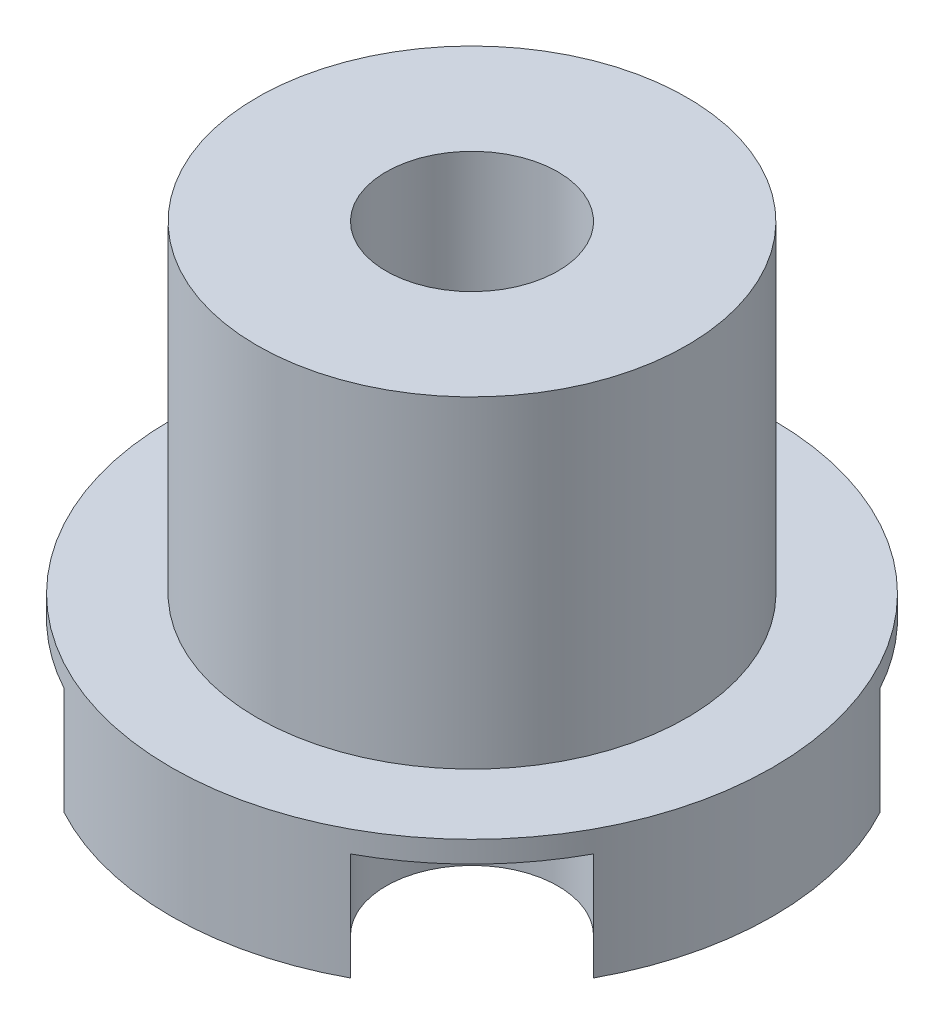
ISO-10303-21;
HEADER;
FILE_DESCRIPTION(('STEP AP214'),'2;1');
FILE_NAME('part.step','',(''),(''),'','','');
FILE_SCHEMA(('AUTOMOTIVE_DESIGN { 1 0 10303 214 1 1 1 1 }'));
ENDSEC;
DATA;
#1=APPLICATION_CONTEXT('core data for automotive mechanical design processes');
#2=APPLICATION_PROTOCOL_DEFINITION('international standard','automotive_design',2000,#1);
#3=PRODUCT_CONTEXT('',#1,'mechanical');
#4=PRODUCT('Part','Part','',(#3));
#5=PRODUCT_RELATED_PRODUCT_CATEGORY('part','',(#4));
#6=PRODUCT_DEFINITION_FORMATION('','',#4);
#7=PRODUCT_DEFINITION_CONTEXT('part definition',#1,'design');
#8=PRODUCT_DEFINITION('design','',#6,#7);
#9=PRODUCT_DEFINITION_SHAPE('','',#8);
#10=(LENGTH_UNIT() NAMED_UNIT(*) SI_UNIT(.MILLI.,.METRE.));
#11=(NAMED_UNIT(*) PLANE_ANGLE_UNIT() SI_UNIT($,.RADIAN.));
#12=(NAMED_UNIT(*) SI_UNIT($,.STERADIAN.) SOLID_ANGLE_UNIT());
#13=UNCERTAINTY_MEASURE_WITH_UNIT(LENGTH_MEASURE(1.E-05),#10,'distance_accuracy_value','');
#14=(GEOMETRIC_REPRESENTATION_CONTEXT(3) GLOBAL_UNCERTAINTY_ASSIGNED_CONTEXT((#13)) GLOBAL_UNIT_ASSIGNED_CONTEXT((#10,
#11,#12)) REPRESENTATION_CONTEXT('',''));
#15=CARTESIAN_POINT('',(0.,0.,0.));
#16=DIRECTION('',(0.,0.,1.));
#17=DIRECTION('',(1.,0.,0.));
#18=AXIS2_PLACEMENT_3D('',#15,#16,#17);
#19=CARTESIAN_POINT('',(-7.77817459305196,5.,-7.77817459305209));
#20=DIRECTION('',(0.,-1.,0.));
#21=DIRECTION('',(0.,0.,-1.));
#22=AXIS2_PLACEMENT_3D('',#19,#20,#21);
#23=CYLINDRICAL_SURFACE('',#22,4.);
#24=CARTESIAN_POINT('',(-7.77817459305196,0.,-7.77817459305209));
#25=DIRECTION('',(0.,-1.,0.));
#26=DIRECTION('',(0.,0.,-1.));
#27=AXIS2_PLACEMENT_3D('',#24,#25,#26);
#28=CIRCLE('',#27,4.);
#29=CARTESIAN_POINT('',(-4.94974746830567,0.,-10.606601717798));
#30=VERTEX_POINT('',#29);
#31=CARTESIAN_POINT('',(-10.6066017177982,0.,-4.94974746830575));
#32=VERTEX_POINT('',#31);
#33=EDGE_CURVE('E165',#30,#32,#28,.T.);
#34=ORIENTED_EDGE('',*,*,#33,.T.);
#35=DIRECTION('',(0.,-1.,0.));
#36=VECTOR('',#35,1.);
#37=CARTESIAN_POINT('',(-10.6066017177982,5.,-4.94974746830575));
#38=LINE('',#37,#36);
#39=CARTESIAN_POINT('',(-10.6066017177982,5.,-4.94974746830575));
#40=VERTEX_POINT('',#39);
#41=EDGE_CURVE('E151',#40,#32,#38,.T.);
#42=ORIENTED_EDGE('',*,*,#41,.F.);
#43=CARTESIAN_POINT('',(-7.77817459305196,5.,-7.77817459305209));
#44=DIRECTION('',(0.,-1.,0.));
#45=DIRECTION('',(0.,0.,-1.));
#46=AXIS2_PLACEMENT_3D('',#43,#44,#45);
#47=CIRCLE('',#46,4.);
#48=CARTESIAN_POINT('',(-4.94974746830578,5.,-10.6066017177983));
#49=VERTEX_POINT('',#48);
#50=EDGE_CURVE('E163',#49,#40,#47,.T.);
#51=ORIENTED_EDGE('',*,*,#50,.F.);
#52=DIRECTION('',(0.,-1.,0.));
#53=VECTOR('',#52,1.);
#54=CARTESIAN_POINT('',(-4.94974746830567,5.,-10.606601717798));
#55=LINE('',#54,#53);
#56=EDGE_CURVE('E49',#49,#30,#55,.T.);
#57=ORIENTED_EDGE('',*,*,#56,.T.);
#58=EDGE_LOOP('',(#34,#42,#51,#57));
#59=FACE_BOUND('',#58,.T.);
#60=ADVANCED_FACE('F34',(#59),#23,.F.);
#61=CARTESIAN_POINT('',(7.77817459305212,5.,-7.77817459305193));
#62=DIRECTION('',(0.,-1.,0.));
#63=DIRECTION('',(0.,0.,-1.));
#64=AXIS2_PLACEMENT_3D('',#61,#62,#63);
#65=CYLINDRICAL_SURFACE('',#64,4.);
#66=CARTESIAN_POINT('',(7.77817459305212,0.,-7.77817459305193));
#67=DIRECTION('',(0.,-1.,0.));
#68=DIRECTION('',(0.,0.,-1.));
#69=AXIS2_PLACEMENT_3D('',#66,#67,#68);
#70=CIRCLE('',#69,4.);
#71=CARTESIAN_POINT('',(10.606601717798,0.,-4.94974746830556));
#72=VERTEX_POINT('',#71);
#73=CARTESIAN_POINT('',(4.94974746830586,0.,-10.6066017177982));
#74=VERTEX_POINT('',#73);
#75=EDGE_CURVE('E169',#72,#74,#70,.T.);
#76=ORIENTED_EDGE('',*,*,#75,.T.);
#77=DIRECTION('',(0.,-1.,0.));
#78=VECTOR('',#77,1.);
#79=CARTESIAN_POINT('',(4.94974746830586,5.,-10.6066017177982));
#80=LINE('',#79,#78);
#81=CARTESIAN_POINT('',(4.94974746830586,5.,-10.6066017177982));
#82=VERTEX_POINT('',#81);
#83=EDGE_CURVE('E254',#82,#74,#80,.T.);
#84=ORIENTED_EDGE('',*,*,#83,.F.);
#85=CARTESIAN_POINT('',(7.77817459305212,5.,-7.77817459305193));
#86=DIRECTION('',(0.,-1.,0.));
#87=DIRECTION('',(0.,0.,-1.));
#88=AXIS2_PLACEMENT_3D('',#85,#86,#87);
#89=CIRCLE('',#88,4.);
#90=CARTESIAN_POINT('',(10.6066017177983,5.,-4.94974746830572));
#91=VERTEX_POINT('',#90);
#92=EDGE_CURVE('E172',#91,#82,#89,.T.);
#93=ORIENTED_EDGE('',*,*,#92,.F.);
#94=DIRECTION('',(0.,-1.,0.));
#95=VECTOR('',#94,1.);
#96=CARTESIAN_POINT('',(10.606601717798,5.,-4.94974746830556));
#97=LINE('',#96,#95);
#98=EDGE_CURVE('E57',#91,#72,#97,.T.);
#99=ORIENTED_EDGE('',*,*,#98,.T.);
#100=EDGE_LOOP('',(#76,#84,#93,#99));
#101=FACE_BOUND('',#100,.T.);
#102=ADVANCED_FACE('F347',(#101),#65,.F.);
#103=CARTESIAN_POINT('',(7.77817459305201,5.,7.77817459305204));
#104=DIRECTION('',(0.,-1.,0.));
#105=DIRECTION('',(0.,0.,-1.));
#106=AXIS2_PLACEMENT_3D('',#103,#104,#105);
#107=CYLINDRICAL_SURFACE('',#106,4.);
#108=CARTESIAN_POINT('',(7.77817459305201,0.,7.77817459305204));
#109=DIRECTION('',(0.,1.,0.));
#110=DIRECTION('',(0.,0.,1.));
#111=AXIS2_PLACEMENT_3D('',#108,#109,#110);
#112=CIRCLE('',#111,4.);
#113=CARTESIAN_POINT('',(10.6066017177982,0.,4.94974746830582));
#114=VERTEX_POINT('',#113);
#115=CARTESIAN_POINT('',(4.9497474683056,0.,10.606601717798));
#116=VERTEX_POINT('',#115);
#117=EDGE_CURVE('E230',#114,#116,#112,.T.);
#118=ORIENTED_EDGE('',*,*,#117,.F.);
#119=DIRECTION('',(0.,-1.,0.));
#120=VECTOR('',#119,1.);
#121=CARTESIAN_POINT('',(10.6066017177982,5.,4.94974746830582));
#122=LINE('',#121,#120);
#123=CARTESIAN_POINT('',(10.6066017177982,5.,4.94974746830582));
#124=VERTEX_POINT('',#123);
#125=EDGE_CURVE('E271',#124,#114,#122,.T.);
#126=ORIENTED_EDGE('',*,*,#125,.F.);
#127=CARTESIAN_POINT('',(7.77817459305201,5.,7.77817459305204));
#128=DIRECTION('',(0.,-1.,0.));
#129=DIRECTION('',(0.,0.,-1.));
#130=AXIS2_PLACEMENT_3D('',#127,#128,#129);
#131=CIRCLE('',#130,4.);
#132=CARTESIAN_POINT('',(4.94974746830581,5.,10.6066017177982));
#133=VERTEX_POINT('',#132);
#134=EDGE_CURVE('E180',#133,#124,#131,.T.);
#135=ORIENTED_EDGE('',*,*,#134,.F.);
#136=DIRECTION('',(0.,-1.,0.));
#137=VECTOR('',#136,1.);
#138=CARTESIAN_POINT('',(4.9497474683056,5.,10.606601717798));
#139=LINE('',#138,#137);
#140=EDGE_CURVE('E268',#133,#116,#139,.T.);
#141=ORIENTED_EDGE('',*,*,#140,.T.);
#142=EDGE_LOOP('',(#118,#126,#135,#141));
#143=FACE_BOUND('',#142,.T.);
#144=ADVANCED_FACE('F314',(#143),#107,.F.);
#145=CARTESIAN_POINT('',(-7.77817459305206,5.,7.77817459305198));
#146=DIRECTION('',(0.,-1.,0.));
#147=DIRECTION('',(0.,0.,-1.));
#148=AXIS2_PLACEMENT_3D('',#145,#146,#147);
#149=CYLINDRICAL_SURFACE('',#148,4.);
#150=CARTESIAN_POINT('',(-7.77817459305206,0.,7.77817459305198));
#151=DIRECTION('',(0.,1.,0.));
#152=DIRECTION('',(0.,0.,1.));
#153=AXIS2_PLACEMENT_3D('',#150,#151,#152);
#154=CIRCLE('',#153,4.);
#155=CARTESIAN_POINT('',(-4.94974746830586,0.,10.6066017177982));
#156=VERTEX_POINT('',#155);
#157=CARTESIAN_POINT('',(-10.606601717798,0.,4.94974746830556));
#158=VERTEX_POINT('',#157);
#159=EDGE_CURVE('E221',#156,#158,#154,.T.);
#160=ORIENTED_EDGE('',*,*,#159,.F.);
#161=DIRECTION('',(0.,-1.,0.));
#162=VECTOR('',#161,1.);
#163=CARTESIAN_POINT('',(-4.94974746830586,5.,10.6066017177982));
#164=LINE('',#163,#162);
#165=CARTESIAN_POINT('',(-4.94974746830586,5.,10.6066017177982));
#166=VERTEX_POINT('',#165);
#167=EDGE_CURVE('E291',#166,#156,#164,.T.);
#168=ORIENTED_EDGE('',*,*,#167,.F.);
#169=CARTESIAN_POINT('',(-7.77817459305206,5.,7.77817459305198));
#170=DIRECTION('',(0.,-1.,0.));
#171=DIRECTION('',(0.,0.,-1.));
#172=AXIS2_PLACEMENT_3D('',#169,#170,#171);
#173=CIRCLE('',#172,4.);
#174=CARTESIAN_POINT('',(-10.6066017177982,5.,4.94974746830577));
#175=VERTEX_POINT('',#174);
#176=EDGE_CURVE('E184',#175,#166,#173,.T.);
#177=ORIENTED_EDGE('',*,*,#176,.F.);
#178=DIRECTION('',(0.,-1.,0.));
#179=VECTOR('',#178,1.);
#180=CARTESIAN_POINT('',(-10.606601717798,5.,4.94974746830556));
#181=LINE('',#180,#179);
#182=EDGE_CURVE('E288',#175,#158,#181,.T.);
#183=ORIENTED_EDGE('',*,*,#182,.T.);
#184=EDGE_LOOP('',(#160,#168,#177,#183));
#185=FACE_BOUND('',#184,.T.);
#186=ADVANCED_FACE('F332',(#185),#149,.F.);
#187=CARTESIAN_POINT('',(0.,6.,0.));
#188=DIRECTION('',(0.,1.,0.));
#189=DIRECTION('',(0.,0.,1.));
#190=AXIS2_PLACEMENT_3D('',#187,#188,#189);
#191=PLANE('',#190);
#192=CARTESIAN_POINT('',(0.,6.,0.));
#193=DIRECTION('',(0.,1.,0.));
#194=DIRECTION('',(0.,0.,1.));
#195=AXIS2_PLACEMENT_3D('',#192,#193,#194);
#196=CIRCLE('',#195,14.);
#197=CARTESIAN_POINT('',(0.,6.,14.));
#198=VERTEX_POINT('',#197);
#199=EDGE_CURVE('E218',#198,#198,#196,.T.);
#200=ORIENTED_EDGE('',*,*,#199,.T.);
#201=EDGE_LOOP('',(#200));
#202=FACE_BOUND('',#201,.T.);
#203=CARTESIAN_POINT('',(0.,6.,0.));
#204=DIRECTION('',(0.,1.,0.));
#205=DIRECTION('',(0.,0.,1.));
#206=AXIS2_PLACEMENT_3D('',#203,#204,#205);
#207=CIRCLE('',#206,10.);
#208=CARTESIAN_POINT('',(0.,6.,10.));
#209=VERTEX_POINT('',#208);
#210=EDGE_CURVE('E209',#209,#209,#207,.T.);
#211=ORIENTED_EDGE('',*,*,#210,.F.);
#212=EDGE_LOOP('',(#211));
#213=FACE_BOUND('',#212,.T.);
#214=ADVANCED_FACE('F366',(#202,#213),#191,.T.);
#215=CARTESIAN_POINT('',(0.,6.,0.));
#216=DIRECTION('',(0.,-1.,0.));
#217=DIRECTION('',(0.,0.,-1.));
#218=AXIS2_PLACEMENT_3D('',#215,#216,#217);
#219=CYLINDRICAL_SURFACE('',#218,14.);
#220=CARTESIAN_POINT('',(0.,0.,0.));
#221=DIRECTION('',(0.,1.,0.));
#222=DIRECTION('',(0.,0.,1.));
#223=AXIS2_PLACEMENT_3D('',#220,#221,#222);
#224=CIRCLE('',#223,14.);
#225=CARTESIAN_POINT('',(6.65840585575901,0.,-12.3152601052513));
#226=VERTEX_POINT('',#225);
#227=CARTESIAN_POINT('',(-6.658405855759,0.,-12.3152601052513));
#228=VERTEX_POINT('',#227);
#229=EDGE_CURVE('E323',#226,#228,#224,.T.);
#230=ORIENTED_EDGE('',*,*,#229,.T.);
#231=DIRECTION('',(0.,-1.,0.));
#232=VECTOR('',#231,1.);
#233=CARTESIAN_POINT('',(-6.658405855759,6.,-12.3152601052513));
#234=LINE('',#233,#232);
#235=CARTESIAN_POINT('',(-6.658405855759,5.,-12.3152601052513));
#236=VERTEX_POINT('',#235);
#237=EDGE_CURVE('E166',#228,#236,#234,.F.);
#238=ORIENTED_EDGE('',*,*,#237,.T.);
#239=CARTESIAN_POINT('',(0.,5.,0.));
#240=DIRECTION('',(0.,-1.,0.));
#241=DIRECTION('',(0.,0.,-1.));
#242=AXIS2_PLACEMENT_3D('',#239,#240,#241);
#243=CIRCLE('',#242,14.);
#244=CARTESIAN_POINT('',(-12.3152601052514,5.,-6.65840585575889));
#245=VERTEX_POINT('',#244);
#246=EDGE_CURVE('E11',#245,#236,#243,.T.);
#247=ORIENTED_EDGE('',*,*,#246,.F.);
#248=DIRECTION('',(0.,-1.,0.));
#249=VECTOR('',#248,1.);
#250=CARTESIAN_POINT('',(-12.3152601052514,6.,-6.65840585575889));
#251=LINE('',#250,#249);
#252=CARTESIAN_POINT('',(-12.3152601052514,0.,-6.65840585575889));
#253=VERTEX_POINT('',#252);
#254=EDGE_CURVE('E154',#245,#253,#251,.T.);
#255=ORIENTED_EDGE('',*,*,#254,.T.);
#256=CARTESIAN_POINT('',(-12.3152601052514,0.,6.65840585575887));
#257=VERTEX_POINT('',#256);
#258=EDGE_CURVE('E215',#253,#257,#224,.T.);
#259=ORIENTED_EDGE('',*,*,#258,.T.);
#260=DIRECTION('',(0.,-1.,0.));
#261=VECTOR('',#260,1.);
#262=CARTESIAN_POINT('',(-12.3152601052514,6.,6.65840585575887));
#263=LINE('',#262,#261);
#264=CARTESIAN_POINT('',(-12.3152601052514,5.,6.65840585575887));
#265=VERTEX_POINT('',#264);
#266=EDGE_CURVE('E293',#257,#265,#263,.F.);
#267=ORIENTED_EDGE('',*,*,#266,.T.);
#268=CARTESIAN_POINT('',(0.,5.,0.));
#269=DIRECTION('',(0.,-1.,0.));
#270=DIRECTION('',(0.,0.,-1.));
#271=AXIS2_PLACEMENT_3D('',#268,#269,#270);
#272=CIRCLE('',#271,14.);
#273=CARTESIAN_POINT('',(-6.65840585575901,5.,12.3152601052513));
#274=VERTEX_POINT('',#273);
#275=EDGE_CURVE('E228',#274,#265,#272,.T.);
#276=ORIENTED_EDGE('',*,*,#275,.F.);
#277=DIRECTION('',(0.,-1.,0.));
#278=VECTOR('',#277,1.);
#279=CARTESIAN_POINT('',(-6.65840585575901,6.,12.3152601052513));
#280=LINE('',#279,#278);
#281=CARTESIAN_POINT('',(-6.65840585575901,0.,12.3152601052513));
#282=VERTEX_POINT('',#281);
#283=EDGE_CURVE('E174',#274,#282,#280,.T.);
#284=ORIENTED_EDGE('',*,*,#283,.T.);
#285=CARTESIAN_POINT('',(6.65840585575891,0.,12.3152601052513));
#286=VERTEX_POINT('',#285);
#287=EDGE_CURVE('E222',#282,#286,#224,.T.);
#288=ORIENTED_EDGE('',*,*,#287,.T.);
#289=DIRECTION('',(0.,-1.,0.));
#290=VECTOR('',#289,1.);
#291=CARTESIAN_POINT('',(6.65840585575891,6.,12.3152601052513));
#292=LINE('',#291,#290);
#293=CARTESIAN_POINT('',(6.65840585575891,5.,12.3152601052513));
#294=VERTEX_POINT('',#293);
#295=EDGE_CURVE('E273',#286,#294,#292,.F.);
#296=ORIENTED_EDGE('',*,*,#295,.T.);
#297=CARTESIAN_POINT('',(0.,5.,0.));
#298=DIRECTION('',(0.,-1.,0.));
#299=DIRECTION('',(0.,0.,-1.));
#300=AXIS2_PLACEMENT_3D('',#297,#298,#299);
#301=CIRCLE('',#300,14.);
#302=CARTESIAN_POINT('',(12.3152601052513,5.,6.65840585575897));
#303=VERTEX_POINT('',#302);
#304=EDGE_CURVE('E233',#303,#294,#301,.T.);
#305=ORIENTED_EDGE('',*,*,#304,.F.);
#306=DIRECTION('',(0.,-1.,0.));
#307=VECTOR('',#306,1.);
#308=CARTESIAN_POINT('',(12.3152601052513,6.,6.65840585575897));
#309=LINE('',#308,#307);
#310=CARTESIAN_POINT('',(12.3152601052513,0.,6.65840585575897));
#311=VERTEX_POINT('',#310);
#312=EDGE_CURVE('E278',#303,#311,#309,.T.);
#313=ORIENTED_EDGE('',*,*,#312,.T.);
#314=CARTESIAN_POINT('',(12.3152601052514,0.,-6.65840585575887));
#315=VERTEX_POINT('',#314);
#316=EDGE_CURVE('E225',#311,#315,#224,.T.);
#317=ORIENTED_EDGE('',*,*,#316,.T.);
#318=DIRECTION('',(0.,-1.,0.));
#319=VECTOR('',#318,1.);
#320=CARTESIAN_POINT('',(12.3152601052514,6.,-6.65840585575887));
#321=LINE('',#320,#319);
#322=CARTESIAN_POINT('',(12.3152601052514,5.,-6.65840585575887));
#323=VERTEX_POINT('',#322);
#324=EDGE_CURVE('E245',#315,#323,#321,.F.);
#325=ORIENTED_EDGE('',*,*,#324,.T.);
#326=CARTESIAN_POINT('',(0.,5.,0.));
#327=DIRECTION('',(0.,-1.,0.));
#328=DIRECTION('',(0.,0.,-1.));
#329=AXIS2_PLACEMENT_3D('',#326,#327,#328);
#330=CIRCLE('',#329,14.);
#331=CARTESIAN_POINT('',(6.65840585575901,5.,-12.3152601052513));
#332=VERTEX_POINT('',#331);
#333=EDGE_CURVE('E42',#332,#323,#330,.T.);
#334=ORIENTED_EDGE('',*,*,#333,.F.);
#335=DIRECTION('',(0.,-1.,0.));
#336=VECTOR('',#335,1.);
#337=CARTESIAN_POINT('',(6.65840585575901,6.,-12.3152601052513));
#338=LINE('',#337,#336);
#339=EDGE_CURVE('E253',#332,#226,#338,.T.);
#340=ORIENTED_EDGE('',*,*,#339,.T.);
#341=EDGE_LOOP('',(#230,#238,#247,#255,#259,#267,#276,#284,#288,#296,#305,#313,#317,#325,#334,#340));
#342=FACE_BOUND('',#341,.T.);
#343=ORIENTED_EDGE('',*,*,#199,.F.);
#344=EDGE_LOOP('',(#343));
#345=FACE_BOUND('',#344,.T.);
#346=ADVANCED_FACE('F36',(#342,#345),#219,.T.);
#347=CARTESIAN_POINT('',(0.,0.,0.));
#348=DIRECTION('',(0.,1.,0.));
#349=DIRECTION('',(0.,0.,1.));
#350=AXIS2_PLACEMENT_3D('',#347,#348,#349);
#351=PLANE('',#350);
#352=CARTESIAN_POINT('',(0.,0.,0.));
#353=DIRECTION('',(0.,-1.,0.));
#354=DIRECTION('',(0.,0.,-1.));
#355=AXIS2_PLACEMENT_3D('',#352,#353,#354);
#356=CIRCLE('',#355,4.);
#357=CARTESIAN_POINT('',(0.,0.,-4.));
#358=VERTEX_POINT('',#357);
#359=EDGE_CURVE('E416',#358,#358,#356,.T.);
#360=ORIENTED_EDGE('',*,*,#359,.F.);
#361=EDGE_LOOP('',(#360));
#362=FACE_BOUND('',#361,.T.);
#363=CARTESIAN_POINT('',(0.,0.,-9.5));
#364=DIRECTION('',(0.,-1.,0.));
#365=DIRECTION('',(0.,0.,-1.));
#366=AXIS2_PLACEMENT_3D('',#363,#364,#365);
#367=CIRCLE('',#366,1.);
#368=CARTESIAN_POINT('',(0.,0.,-10.5));
#369=VERTEX_POINT('',#368);
#370=EDGE_CURVE('E187',#369,#369,#367,.T.);
#371=ORIENTED_EDGE('',*,*,#370,.F.);
#372=EDGE_LOOP('',(#371));
#373=FACE_BOUND('',#372,.T.);
#374=CARTESIAN_POINT('',(0.,0.,9.5));
#375=DIRECTION('',(0.,-1.,0.));
#376=DIRECTION('',(0.,0.,-1.));
#377=AXIS2_PLACEMENT_3D('',#374,#375,#376);
#378=CIRCLE('',#377,1.);
#379=CARTESIAN_POINT('',(0.,0.,8.5));
#380=VERTEX_POINT('',#379);
#381=EDGE_CURVE('E191',#380,#380,#378,.T.);
#382=ORIENTED_EDGE('',*,*,#381,.F.);
#383=EDGE_LOOP('',(#382));
#384=FACE_BOUND('',#383,.T.);
#385=CARTESIAN_POINT('',(8.,0.,0.));
#386=DIRECTION('',(0.,-1.,0.));
#387=DIRECTION('',(0.,0.,-1.));
#388=AXIS2_PLACEMENT_3D('',#385,#386,#387);
#389=CIRCLE('',#388,1.);
#390=CARTESIAN_POINT('',(8.,0.,-1.));
#391=VERTEX_POINT('',#390);
#392=EDGE_CURVE('E197',#391,#391,#389,.T.);
#393=ORIENTED_EDGE('',*,*,#392,.F.);
#394=EDGE_LOOP('',(#393));
#395=FACE_BOUND('',#394,.T.);
#396=CARTESIAN_POINT('',(-8.,0.,0.));
#397=DIRECTION('',(0.,-1.,0.));
#398=DIRECTION('',(0.,0.,-1.));
#399=AXIS2_PLACEMENT_3D('',#396,#397,#398);
#400=CIRCLE('',#399,1.);
#401=CARTESIAN_POINT('',(-8.,0.,-1.));
#402=VERTEX_POINT('',#401);
#403=EDGE_CURVE('E203',#402,#402,#400,.T.);
#404=ORIENTED_EDGE('',*,*,#403,.F.);
#405=EDGE_LOOP('',(#404));
#406=FACE_BOUND('',#405,.T.);
#407=ORIENTED_EDGE('',*,*,#258,.F.);
#408=DIRECTION('',(-0.70710678118655,0.,-0.707106781186545));
#409=VECTOR('',#408,1.);
#410=CARTESIAN_POINT('',(-15.3332383130999,0.,-9.67638406360737));
#411=LINE('',#410,#409);
#412=EDGE_CURVE('E432',#32,#253,#411,.T.);
#413=ORIENTED_EDGE('',*,*,#412,.F.);
#414=ORIENTED_EDGE('',*,*,#33,.F.);
#415=DIRECTION('',(0.707106781186551,0.,0.707106781186544));
#416=VECTOR('',#415,1.);
#417=CARTESIAN_POINT('',(-4.94974746830567,0.,-10.606601717798));
#418=LINE('',#417,#416);
#419=EDGE_CURVE('E158',#228,#30,#418,.T.);
#420=ORIENTED_EDGE('',*,*,#419,.F.);
#421=ORIENTED_EDGE('',*,*,#229,.F.);
#422=DIRECTION('',(0.707106781186552,0.,-0.707106781186543));
#423=VECTOR('',#422,1.);
#424=CARTESIAN_POINT('',(9.67638406360753,0.,-15.3332383130998));
#425=LINE('',#424,#423);
#426=EDGE_CURVE('E441',#74,#226,#425,.T.);
#427=ORIENTED_EDGE('',*,*,#426,.F.);
#428=ORIENTED_EDGE('',*,*,#75,.F.);
#429=DIRECTION('',(-0.707106781186551,0.,0.707106781186544));
#430=VECTOR('',#429,1.);
#431=CARTESIAN_POINT('',(10.606601717798,0.,-4.94974746830556));
#432=LINE('',#431,#430);
#433=EDGE_CURVE('E322',#315,#72,#432,.T.);
#434=ORIENTED_EDGE('',*,*,#433,.F.);
#435=ORIENTED_EDGE('',*,*,#316,.F.);
#436=DIRECTION('',(0.707106781186545,0.,0.70710678118655));
#437=VECTOR('',#436,1.);
#438=CARTESIAN_POINT('',(15.3332383130998,0.,9.67638406360748));
#439=LINE('',#438,#437);
#440=EDGE_CURVE('E256',#114,#311,#439,.T.);
#441=ORIENTED_EDGE('',*,*,#440,.F.);
#442=ORIENTED_EDGE('',*,*,#117,.T.);
#443=DIRECTION('',(-0.707106781186546,0.,-0.707106781186549));
#444=VECTOR('',#443,1.);
#445=CARTESIAN_POINT('',(4.9497474683056,0.,10.606601717798));
#446=LINE('',#445,#444);
#447=EDGE_CURVE('E265',#286,#116,#446,.T.);
#448=ORIENTED_EDGE('',*,*,#447,.F.);
#449=ORIENTED_EDGE('',*,*,#287,.F.);
#450=DIRECTION('',(-0.707106781186552,0.,0.707106781186543));
#451=VECTOR('',#450,1.);
#452=CARTESIAN_POINT('',(-9.67638406360753,0.,15.3332383130998));
#453=LINE('',#452,#451);
#454=EDGE_CURVE('E280',#156,#282,#453,.T.);
#455=ORIENTED_EDGE('',*,*,#454,.F.);
#456=ORIENTED_EDGE('',*,*,#159,.T.);
#457=DIRECTION('',(0.707106781186551,0.,-0.707106781186544));
#458=VECTOR('',#457,1.);
#459=CARTESIAN_POINT('',(-10.606601717798,0.,4.94974746830556));
#460=LINE('',#459,#458);
#461=EDGE_CURVE('E285',#257,#158,#460,.T.);
#462=ORIENTED_EDGE('',*,*,#461,.F.);
#463=EDGE_LOOP('',(#407,#413,#414,#420,#421,#427,#428,#434,#435,#441,#442,#448,#449,#455,#456,#462));
#464=FACE_BOUND('',#463,.T.);
#465=ADVANCED_FACE('F305',(#362,#373,#384,#395,#406,#464),#351,.F.);
#466=CARTESIAN_POINT('',(0.,21.,0.));
#467=DIRECTION('',(0.,-1.,0.));
#468=DIRECTION('',(0.,0.,-1.));
#469=AXIS2_PLACEMENT_3D('',#466,#467,#468);
#470=CYLINDRICAL_SURFACE('',#469,10.);
#471=CARTESIAN_POINT('',(0.,21.,0.));
#472=DIRECTION('',(0.,1.,0.));
#473=DIRECTION('',(0.,0.,1.));
#474=AXIS2_PLACEMENT_3D('',#471,#472,#473);
#475=CIRCLE('',#474,10.);
#476=CARTESIAN_POINT('',(0.,21.,10.));
#477=VERTEX_POINT('',#476);
#478=EDGE_CURVE('E212',#477,#477,#475,.T.);
#479=ORIENTED_EDGE('',*,*,#478,.F.);
#480=EDGE_LOOP('',(#479));
#481=FACE_BOUND('',#480,.T.);
#482=ORIENTED_EDGE('',*,*,#210,.T.);
#483=EDGE_LOOP('',(#482));
#484=FACE_BOUND('',#483,.T.);
#485=ADVANCED_FACE('F401',(#481,#484),#470,.T.);
#486=CARTESIAN_POINT('',(0.,21.,0.));
#487=DIRECTION('',(0.,1.,0.));
#488=DIRECTION('',(0.,0.,1.));
#489=AXIS2_PLACEMENT_3D('',#486,#487,#488);
#490=PLANE('',#489);
#491=CARTESIAN_POINT('',(0.,21.,0.));
#492=DIRECTION('',(0.,-1.,0.));
#493=DIRECTION('',(0.,0.,-1.));
#494=AXIS2_PLACEMENT_3D('',#491,#492,#493);
#495=CIRCLE('',#494,4.);
#496=CARTESIAN_POINT('',(0.,21.,-4.));
#497=VERTEX_POINT('',#496);
#498=EDGE_CURVE('E429',#497,#497,#495,.T.);
#499=ORIENTED_EDGE('',*,*,#498,.T.);
#500=EDGE_LOOP('',(#499));
#501=FACE_BOUND('',#500,.T.);
#502=ORIENTED_EDGE('',*,*,#478,.T.);
#503=EDGE_LOOP('',(#502));
#504=FACE_BOUND('',#503,.T.);
#505=ADVANCED_FACE('F397',(#501,#504),#490,.T.);
#506=CARTESIAN_POINT('',(-8.,5.,0.));
#507=DIRECTION('',(0.,-1.,0.));
#508=DIRECTION('',(0.,0.,-1.));
#509=AXIS2_PLACEMENT_3D('',#506,#507,#508);
#510=CYLINDRICAL_SURFACE('',#509,1.);
#511=CARTESIAN_POINT('',(-8.,5.,0.));
#512=DIRECTION('',(0.,-1.,0.));
#513=DIRECTION('',(0.,0.,-1.));
#514=AXIS2_PLACEMENT_3D('',#511,#512,#513);
#515=CIRCLE('',#514,1.);
#516=CARTESIAN_POINT('',(-8.,5.,-1.));
#517=VERTEX_POINT('',#516);
#518=EDGE_CURVE('E206',#517,#517,#515,.T.);
#519=ORIENTED_EDGE('',*,*,#518,.F.);
#520=EDGE_LOOP('',(#519));
#521=FACE_BOUND('',#520,.T.);
#522=ORIENTED_EDGE('',*,*,#403,.T.);
#523=EDGE_LOOP('',(#522));
#524=FACE_BOUND('',#523,.T.);
#525=ADVANCED_FACE('F393',(#521,#524),#510,.F.);
#526=CARTESIAN_POINT('',(-8.,5.,0.));
#527=DIRECTION('',(0.,-1.,0.));
#528=DIRECTION('',(0.,0.,-1.));
#529=AXIS2_PLACEMENT_3D('',#526,#527,#528);
#530=PLANE('',#529);
#531=ORIENTED_EDGE('',*,*,#518,.T.);
#532=EDGE_LOOP('',(#531));
#533=FACE_BOUND('',#532,.T.);
#534=ADVANCED_FACE('F389',(#533),#530,.T.);
#535=CARTESIAN_POINT('',(8.,5.,0.));
#536=DIRECTION('',(0.,-1.,0.));
#537=DIRECTION('',(0.,0.,-1.));
#538=AXIS2_PLACEMENT_3D('',#535,#536,#537);
#539=CYLINDRICAL_SURFACE('',#538,1.);
#540=CARTESIAN_POINT('',(8.,5.,0.));
#541=DIRECTION('',(0.,-1.,0.));
#542=DIRECTION('',(0.,0.,-1.));
#543=AXIS2_PLACEMENT_3D('',#540,#541,#542);
#544=CIRCLE('',#543,1.);
#545=CARTESIAN_POINT('',(8.,5.,-1.));
#546=VERTEX_POINT('',#545);
#547=EDGE_CURVE('E200',#546,#546,#544,.T.);
#548=ORIENTED_EDGE('',*,*,#547,.F.);
#549=EDGE_LOOP('',(#548));
#550=FACE_BOUND('',#549,.T.);
#551=ORIENTED_EDGE('',*,*,#392,.T.);
#552=EDGE_LOOP('',(#551));
#553=FACE_BOUND('',#552,.T.);
#554=ADVANCED_FACE('F385',(#550,#553),#539,.F.);
#555=CARTESIAN_POINT('',(8.,5.,0.));
#556=DIRECTION('',(0.,-1.,0.));
#557=DIRECTION('',(0.,0.,-1.));
#558=AXIS2_PLACEMENT_3D('',#555,#556,#557);
#559=PLANE('',#558);
#560=ORIENTED_EDGE('',*,*,#547,.T.);
#561=EDGE_LOOP('',(#560));
#562=FACE_BOUND('',#561,.T.);
#563=ADVANCED_FACE('F381',(#562),#559,.T.);
#564=CARTESIAN_POINT('',(0.,5.,9.5));
#565=DIRECTION('',(0.,-1.,0.));
#566=DIRECTION('',(0.,0.,-1.));
#567=AXIS2_PLACEMENT_3D('',#564,#565,#566);
#568=CYLINDRICAL_SURFACE('',#567,1.);
#569=CARTESIAN_POINT('',(0.,5.,9.5));
#570=DIRECTION('',(0.,-1.,0.));
#571=DIRECTION('',(0.,0.,-1.));
#572=AXIS2_PLACEMENT_3D('',#569,#570,#571);
#573=CIRCLE('',#572,1.);
#574=CARTESIAN_POINT('',(0.,5.,8.5));
#575=VERTEX_POINT('',#574);
#576=EDGE_CURVE('E194',#575,#575,#573,.T.);
#577=ORIENTED_EDGE('',*,*,#576,.F.);
#578=EDGE_LOOP('',(#577));
#579=FACE_BOUND('',#578,.T.);
#580=ORIENTED_EDGE('',*,*,#381,.T.);
#581=EDGE_LOOP('',(#580));
#582=FACE_BOUND('',#581,.T.);
#583=ADVANCED_FACE('F377',(#579,#582),#568,.F.);
#584=CARTESIAN_POINT('',(0.,5.,9.5));
#585=DIRECTION('',(0.,-1.,0.));
#586=DIRECTION('',(0.,0.,-1.));
#587=AXIS2_PLACEMENT_3D('',#584,#585,#586);
#588=PLANE('',#587);
#589=ORIENTED_EDGE('',*,*,#576,.T.);
#590=EDGE_LOOP('',(#589));
#591=FACE_BOUND('',#590,.T.);
#592=ADVANCED_FACE('F373',(#591),#588,.T.);
#593=CARTESIAN_POINT('',(0.,5.,-9.5));
#594=DIRECTION('',(0.,-1.,0.));
#595=DIRECTION('',(0.,0.,-1.));
#596=AXIS2_PLACEMENT_3D('',#593,#594,#595);
#597=CYLINDRICAL_SURFACE('',#596,1.);
#598=CARTESIAN_POINT('',(0.,5.,-9.5));
#599=DIRECTION('',(0.,-1.,0.));
#600=DIRECTION('',(0.,0.,-1.));
#601=AXIS2_PLACEMENT_3D('',#598,#599,#600);
#602=CIRCLE('',#601,1.);
#603=CARTESIAN_POINT('',(0.,5.,-10.5));
#604=VERTEX_POINT('',#603);
#605=EDGE_CURVE('E188',#604,#604,#602,.T.);
#606=ORIENTED_EDGE('',*,*,#605,.F.);
#607=EDGE_LOOP('',(#606));
#608=FACE_BOUND('',#607,.T.);
#609=ORIENTED_EDGE('',*,*,#370,.T.);
#610=EDGE_LOOP('',(#609));
#611=FACE_BOUND('',#610,.T.);
#612=ADVANCED_FACE('F369',(#608,#611),#597,.F.);
#613=CARTESIAN_POINT('',(0.,5.,-9.5));
#614=DIRECTION('',(0.,-1.,0.));
#615=DIRECTION('',(0.,0.,-1.));
#616=AXIS2_PLACEMENT_3D('',#613,#614,#615);
#617=PLANE('',#616);
#618=ORIENTED_EDGE('',*,*,#605,.T.);
#619=EDGE_LOOP('',(#618));
#620=FACE_BOUND('',#619,.T.);
#621=ADVANCED_FACE('F363',(#620),#617,.T.);
#622=CARTESIAN_POINT('',(-7.77817459305206,5.,7.77817459305198));
#623=DIRECTION('',(0.,-1.,0.));
#624=DIRECTION('',(0.,0.,-1.));
#625=AXIS2_PLACEMENT_3D('',#622,#623,#624);
#626=PLANE('',#625);
#627=ORIENTED_EDGE('',*,*,#176,.T.);
#628=DIRECTION('',(-0.707106781186552,0.,0.707106781186543));
#629=VECTOR('',#628,1.);
#630=CARTESIAN_POINT('',(-9.67638406360753,5.,15.3332383130998));
#631=LINE('',#630,#629);
#632=EDGE_CURVE('E281',#166,#274,#631,.T.);
#633=ORIENTED_EDGE('',*,*,#632,.T.);
#634=ORIENTED_EDGE('',*,*,#275,.T.);
#635=DIRECTION('',(0.707106781186551,0.,-0.707106781186544));
#636=VECTOR('',#635,1.);
#637=CARTESIAN_POINT('',(-10.606601717798,5.,4.94974746830556));
#638=LINE('',#637,#636);
#639=EDGE_CURVE('E284',#265,#175,#638,.T.);
#640=ORIENTED_EDGE('',*,*,#639,.T.);
#641=EDGE_LOOP('',(#627,#633,#634,#640));
#642=FACE_BOUND('',#641,.T.);
#643=ADVANCED_FACE('F335',(#642),#626,.T.);
#644=CARTESIAN_POINT('',(7.77817459305201,5.,7.77817459305204));
#645=DIRECTION('',(0.,-1.,0.));
#646=DIRECTION('',(0.,0.,-1.));
#647=AXIS2_PLACEMENT_3D('',#644,#645,#646);
#648=PLANE('',#647);
#649=ORIENTED_EDGE('',*,*,#134,.T.);
#650=DIRECTION('',(0.707106781186545,0.,0.70710678118655));
#651=VECTOR('',#650,1.);
#652=CARTESIAN_POINT('',(15.3332383130998,5.,9.67638406360748));
#653=LINE('',#652,#651);
#654=EDGE_CURVE('E261',#124,#303,#653,.T.);
#655=ORIENTED_EDGE('',*,*,#654,.T.);
#656=ORIENTED_EDGE('',*,*,#304,.T.);
#657=DIRECTION('',(-0.707106781186546,0.,-0.707106781186549));
#658=VECTOR('',#657,1.);
#659=CARTESIAN_POINT('',(4.9497474683056,5.,10.606601717798));
#660=LINE('',#659,#658);
#661=EDGE_CURVE('E264',#294,#133,#660,.T.);
#662=ORIENTED_EDGE('',*,*,#661,.T.);
#663=EDGE_LOOP('',(#649,#655,#656,#662));
#664=FACE_BOUND('',#663,.T.);
#665=ADVANCED_FACE('F317',(#664),#648,.T.);
#666=CARTESIAN_POINT('',(7.77817459305212,5.,-7.77817459305193));
#667=DIRECTION('',(0.,-1.,0.));
#668=DIRECTION('',(0.,0.,-1.));
#669=AXIS2_PLACEMENT_3D('',#666,#667,#668);
#670=PLANE('',#669);
#671=ORIENTED_EDGE('',*,*,#92,.T.);
#672=DIRECTION('',(0.707106781186552,0.,-0.707106781186543));
#673=VECTOR('',#672,1.);
#674=CARTESIAN_POINT('',(9.67638406360753,5.,-15.3332383130998));
#675=LINE('',#674,#673);
#676=EDGE_CURVE('E239',#82,#332,#675,.T.);
#677=ORIENTED_EDGE('',*,*,#676,.T.);
#678=ORIENTED_EDGE('',*,*,#333,.T.);
#679=DIRECTION('',(-0.707106781186551,0.,0.707106781186544));
#680=VECTOR('',#679,1.);
#681=CARTESIAN_POINT('',(10.606601717798,5.,-4.94974746830556));
#682=LINE('',#681,#680);
#683=EDGE_CURVE('E237',#323,#91,#682,.T.);
#684=ORIENTED_EDGE('',*,*,#683,.T.);
#685=EDGE_LOOP('',(#671,#677,#678,#684));
#686=FACE_BOUND('',#685,.T.);
#687=ADVANCED_FACE('F236',(#686),#670,.T.);
#688=CARTESIAN_POINT('',(-7.77817459305196,5.,-7.77817459305209));
#689=DIRECTION('',(0.,-1.,0.));
#690=DIRECTION('',(0.,0.,-1.));
#691=AXIS2_PLACEMENT_3D('',#688,#689,#690);
#692=PLANE('',#691);
#693=ORIENTED_EDGE('',*,*,#50,.T.);
#694=DIRECTION('',(-0.70710678118655,0.,-0.707106781186545));
#695=VECTOR('',#694,1.);
#696=CARTESIAN_POINT('',(-15.3332383130999,5.,-9.67638406360737));
#697=LINE('',#696,#695);
#698=EDGE_CURVE('E148',#40,#245,#697,.T.);
#699=ORIENTED_EDGE('',*,*,#698,.T.);
#700=ORIENTED_EDGE('',*,*,#246,.T.);
#701=DIRECTION('',(0.707106781186551,0.,0.707106781186544));
#702=VECTOR('',#701,1.);
#703=CARTESIAN_POINT('',(-4.94974746830567,5.,-10.606601717798));
#704=LINE('',#703,#702);
#705=EDGE_CURVE('E157',#236,#49,#704,.T.);
#706=ORIENTED_EDGE('',*,*,#705,.T.);
#707=EDGE_LOOP('',(#693,#699,#700,#706));
#708=FACE_BOUND('',#707,.T.);
#709=ADVANCED_FACE('F168',(#708),#692,.T.);
#710=CARTESIAN_POINT('',(-10.606601717798,5.,4.94974746830556));
#711=DIRECTION('',(-0.707106781186544,0.,-0.707106781186551));
#712=DIRECTION('',(-0.707106781186551,0.,0.707106781186544));
#713=AXIS2_PLACEMENT_3D('',#710,#711,#712);
#714=PLANE('',#713);
#715=ORIENTED_EDGE('',*,*,#461,.T.);
#716=ORIENTED_EDGE('',*,*,#182,.F.);
#717=ORIENTED_EDGE('',*,*,#639,.F.);
#718=ORIENTED_EDGE('',*,*,#266,.F.);
#719=EDGE_LOOP('',(#715,#716,#717,#718));
#720=FACE_BOUND('',#719,.T.);
#721=ADVANCED_FACE('F329',(#720),#714,.F.);
#722=CARTESIAN_POINT('',(-9.67638406360753,5.,15.3332383130998));
#723=DIRECTION('',(0.707106781186543,0.,0.707106781186552));
#724=DIRECTION('',(0.707106781186552,0.,-0.707106781186543));
#725=AXIS2_PLACEMENT_3D('',#722,#723,#724);
#726=PLANE('',#725);
#727=ORIENTED_EDGE('',*,*,#632,.F.);
#728=ORIENTED_EDGE('',*,*,#167,.T.);
#729=ORIENTED_EDGE('',*,*,#454,.T.);
#730=ORIENTED_EDGE('',*,*,#283,.F.);
#731=EDGE_LOOP('',(#727,#728,#729,#730));
#732=FACE_BOUND('',#731,.T.);
#733=ADVANCED_FACE('F336',(#732),#726,.F.);
#734=CARTESIAN_POINT('',(4.9497474683056,5.,10.606601717798));
#735=DIRECTION('',(-0.707106781186549,0.,0.707106781186546));
#736=DIRECTION('',(0.707106781186546,0.,0.707106781186549));
#737=AXIS2_PLACEMENT_3D('',#734,#735,#736);
#738=PLANE('',#737);
#739=ORIENTED_EDGE('',*,*,#447,.T.);
#740=ORIENTED_EDGE('',*,*,#140,.F.);
#741=ORIENTED_EDGE('',*,*,#661,.F.);
#742=ORIENTED_EDGE('',*,*,#295,.F.);
#743=EDGE_LOOP('',(#739,#740,#741,#742));
#744=FACE_BOUND('',#743,.T.);
#745=ADVANCED_FACE('F310',(#744),#738,.F.);
#746=CARTESIAN_POINT('',(15.3332383130998,5.,9.67638406360748));
#747=DIRECTION('',(0.70710678118655,0.,-0.707106781186545));
#748=DIRECTION('',(-0.707106781186545,0.,-0.70710678118655));
#749=AXIS2_PLACEMENT_3D('',#746,#747,#748);
#750=PLANE('',#749);
#751=ORIENTED_EDGE('',*,*,#654,.F.);
#752=ORIENTED_EDGE('',*,*,#125,.T.);
#753=ORIENTED_EDGE('',*,*,#440,.T.);
#754=ORIENTED_EDGE('',*,*,#312,.F.);
#755=EDGE_LOOP('',(#751,#752,#753,#754));
#756=FACE_BOUND('',#755,.T.);
#757=ADVANCED_FACE('F320',(#756),#750,.F.);
#758=CARTESIAN_POINT('',(10.606601717798,5.,-4.94974746830556));
#759=DIRECTION('',(0.707106781186544,0.,0.707106781186551));
#760=DIRECTION('',(0.707106781186551,0.,-0.707106781186544));
#761=AXIS2_PLACEMENT_3D('',#758,#759,#760);
#762=PLANE('',#761);
#763=ORIENTED_EDGE('',*,*,#433,.T.);
#764=ORIENTED_EDGE('',*,*,#98,.F.);
#765=ORIENTED_EDGE('',*,*,#683,.F.);
#766=ORIENTED_EDGE('',*,*,#324,.F.);
#767=EDGE_LOOP('',(#763,#764,#765,#766));
#768=FACE_BOUND('',#767,.T.);
#769=ADVANCED_FACE('F244',(#768),#762,.F.);
#770=CARTESIAN_POINT('',(9.67638406360753,5.,-15.3332383130998));
#771=DIRECTION('',(-0.707106781186543,0.,-0.707106781186552));
#772=DIRECTION('',(-0.707106781186552,0.,0.707106781186543));
#773=AXIS2_PLACEMENT_3D('',#770,#771,#772);
#774=PLANE('',#773);
#775=ORIENTED_EDGE('',*,*,#676,.F.);
#776=ORIENTED_EDGE('',*,*,#83,.T.);
#777=ORIENTED_EDGE('',*,*,#426,.T.);
#778=ORIENTED_EDGE('',*,*,#339,.F.);
#779=EDGE_LOOP('',(#775,#776,#777,#778));
#780=FACE_BOUND('',#779,.T.);
#781=ADVANCED_FACE('F448',(#780),#774,.F.);
#782=CARTESIAN_POINT('',(-4.94974746830567,5.,-10.606601717798));
#783=DIRECTION('',(0.707106781186544,0.,-0.707106781186551));
#784=DIRECTION('',(-0.707106781186551,0.,-0.707106781186544));
#785=AXIS2_PLACEMENT_3D('',#782,#783,#784);
#786=PLANE('',#785);
#787=ORIENTED_EDGE('',*,*,#419,.T.);
#788=ORIENTED_EDGE('',*,*,#56,.F.);
#789=ORIENTED_EDGE('',*,*,#705,.F.);
#790=ORIENTED_EDGE('',*,*,#237,.F.);
#791=EDGE_LOOP('',(#787,#788,#789,#790));
#792=FACE_BOUND('',#791,.T.);
#793=ADVANCED_FACE('F450',(#792),#786,.F.);
#794=CARTESIAN_POINT('',(-15.3332383130999,5.,-9.67638406360737));
#795=DIRECTION('',(-0.707106781186545,0.,0.70710678118655));
#796=DIRECTION('',(0.70710678118655,0.,0.707106781186545));
#797=AXIS2_PLACEMENT_3D('',#794,#795,#796);
#798=PLANE('',#797);
#799=ORIENTED_EDGE('',*,*,#698,.F.);
#800=ORIENTED_EDGE('',*,*,#41,.T.);
#801=ORIENTED_EDGE('',*,*,#412,.T.);
#802=ORIENTED_EDGE('',*,*,#254,.F.);
#803=EDGE_LOOP('',(#799,#800,#801,#802));
#804=FACE_BOUND('',#803,.T.);
#805=ADVANCED_FACE('F150',(#804),#798,.F.);
#806=CARTESIAN_POINT('',(0.,21.,0.));
#807=DIRECTION('',(0.,-1.,0.));
#808=DIRECTION('',(0.,0.,-1.));
#809=AXIS2_PLACEMENT_3D('',#806,#807,#808);
#810=CYLINDRICAL_SURFACE('',#809,4.);
#811=ORIENTED_EDGE('',*,*,#498,.F.);
#812=EDGE_LOOP('',(#811));
#813=FACE_BOUND('',#812,.T.);
#814=ORIENTED_EDGE('',*,*,#359,.T.);
#815=EDGE_LOOP('',(#814));
#816=FACE_BOUND('',#815,.T.);
#817=ADVANCED_FACE('F487',(#813,#816),#810,.F.);
#818=CLOSED_SHELL('',(#60,#102,#144,#186,#214,#346,#465,#485,#505,#525,#534,#554,#563,#583,#592,
#612,#621,#643,#665,#687,#709,#721,#733,#745,#757,#769,#781,#793,#805,#817));
#819=MANIFOLD_SOLID_BREP('B2',#818);
#820=ADVANCED_BREP_SHAPE_REPRESENTATION('',(#18,#819),#14);
#821=SHAPE_DEFINITION_REPRESENTATION(#9,#820);
ENDSEC;
END-ISO-10303-21;
